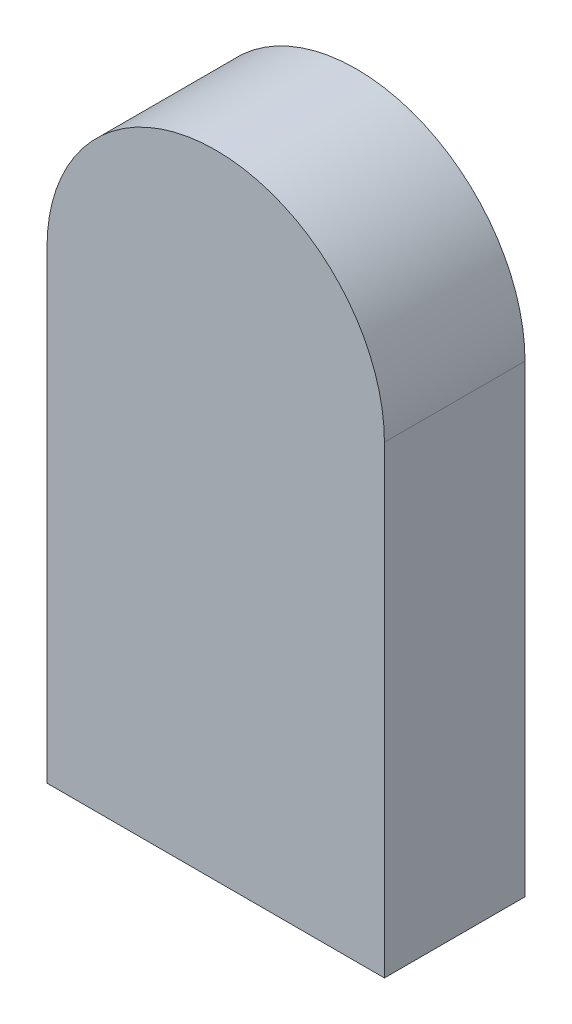
ISO-10303-21;
HEADER;
FILE_DESCRIPTION(('STEP AP214'),'2;1');
FILE_NAME('part.step','',(''),(''),'','','');
FILE_SCHEMA(('AUTOMOTIVE_DESIGN { 1 0 10303 214 1 1 1 1 }'));
ENDSEC;
DATA;
#1=APPLICATION_CONTEXT('core data for automotive mechanical design processes');
#2=APPLICATION_PROTOCOL_DEFINITION('international standard','automotive_design',2000,#1);
#3=PRODUCT_CONTEXT('',#1,'mechanical');
#4=PRODUCT('Part','Part','',(#3));
#5=PRODUCT_RELATED_PRODUCT_CATEGORY('part','',(#4));
#6=PRODUCT_DEFINITION_FORMATION('','',#4);
#7=PRODUCT_DEFINITION_CONTEXT('part definition',#1,'design');
#8=PRODUCT_DEFINITION('design','',#6,#7);
#9=PRODUCT_DEFINITION_SHAPE('','',#8);
#10=(LENGTH_UNIT() NAMED_UNIT(*) SI_UNIT(.MILLI.,.METRE.));
#11=(NAMED_UNIT(*) PLANE_ANGLE_UNIT() SI_UNIT($,.RADIAN.));
#12=(NAMED_UNIT(*) SI_UNIT($,.STERADIAN.) SOLID_ANGLE_UNIT());
#13=UNCERTAINTY_MEASURE_WITH_UNIT(LENGTH_MEASURE(1.E-05),#10,'distance_accuracy_value','');
#14=(GEOMETRIC_REPRESENTATION_CONTEXT(3) GLOBAL_UNCERTAINTY_ASSIGNED_CONTEXT((#13)) GLOBAL_UNIT_ASSIGNED_CONTEXT((#10,
#11,#12)) REPRESENTATION_CONTEXT('',''));
#15=CARTESIAN_POINT('',(0.,0.,0.));
#16=DIRECTION('',(0.,0.,1.));
#17=DIRECTION('',(1.,0.,0.));
#18=AXIS2_PLACEMENT_3D('',#15,#16,#17);
#19=CARTESIAN_POINT('',(-0.37,-4.05,0.));
#20=DIRECTION('',(0.,1.,0.));
#21=DIRECTION('',(1.,0.,0.));
#22=AXIS2_PLACEMENT_3D('',#19,#20,#21);
#23=PLANE('',#22);
#24=DIRECTION('',(1.,0.,0.));
#25=VECTOR('',#24,1.);
#26=CARTESIAN_POINT('',(-0.37,-4.05,0.));
#27=LINE('',#26,#25);
#28=CARTESIAN_POINT('',(-0.37,-4.05,0.));
#29=VERTEX_POINT('',#28);
#30=CARTESIAN_POINT('',(-0.13,-4.05,0.));
#31=VERTEX_POINT('',#30);
#32=EDGE_CURVE('E11',#29,#31,#27,.T.);
#33=ORIENTED_EDGE('',*,*,#32,.T.);
#34=DIRECTION('',(0.,0.,1.));
#35=VECTOR('',#34,1.);
#36=CARTESIAN_POINT('',(-0.13,-4.05,0.));
#37=LINE('',#36,#35);
#38=CARTESIAN_POINT('',(-0.13,-4.05,0.1));
#39=VERTEX_POINT('',#38);
#40=EDGE_CURVE('E24',#31,#39,#37,.T.);
#41=ORIENTED_EDGE('',*,*,#40,.T.);
#42=DIRECTION('',(1.,0.,0.));
#43=VECTOR('',#42,1.);
#44=CARTESIAN_POINT('',(-0.37,-4.05,0.1));
#45=LINE('',#44,#43);
#46=CARTESIAN_POINT('',(-0.37,-4.05,0.1));
#47=VERTEX_POINT('',#46);
#48=EDGE_CURVE('E87',#47,#39,#45,.T.);
#49=ORIENTED_EDGE('',*,*,#48,.F.);
#50=DIRECTION('',(0.,0.,1.));
#51=VECTOR('',#50,1.);
#52=CARTESIAN_POINT('',(-0.37,-4.05,0.));
#53=LINE('',#52,#51);
#54=EDGE_CURVE('E36',#29,#47,#53,.T.);
#55=ORIENTED_EDGE('',*,*,#54,.F.);
#56=EDGE_LOOP('',(#33,#41,#49,#55));
#57=FACE_BOUND('',#56,.T.);
#58=ADVANCED_FACE('F17',(#57),#23,.F.);
#59=CARTESIAN_POINT('',(-0.13,-4.05,0.));
#60=DIRECTION('',(-1.,0.,0.));
#61=DIRECTION('',(0.,1.,0.));
#62=AXIS2_PLACEMENT_3D('',#59,#60,#61);
#63=PLANE('',#62);
#64=DIRECTION('',(0.,1.,0.));
#65=VECTOR('',#64,1.);
#66=CARTESIAN_POINT('',(-0.13,-4.05,0.));
#67=LINE('',#66,#65);
#68=CARTESIAN_POINT('',(-0.13,-3.72,0.));
#69=VERTEX_POINT('',#68);
#70=EDGE_CURVE('E84',#31,#69,#67,.T.);
#71=ORIENTED_EDGE('',*,*,#70,.T.);
#72=DIRECTION('',(0.,0.,1.));
#73=VECTOR('',#72,1.);
#74=CARTESIAN_POINT('',(-0.13,-3.72,0.));
#75=LINE('',#74,#73);
#76=CARTESIAN_POINT('',(-0.13,-3.72,0.1));
#77=VERTEX_POINT('',#76);
#78=EDGE_CURVE('E82',#69,#77,#75,.T.);
#79=ORIENTED_EDGE('',*,*,#78,.T.);
#80=DIRECTION('',(0.,1.,0.));
#81=VECTOR('',#80,1.);
#82=CARTESIAN_POINT('',(-0.13,-4.05,0.1));
#83=LINE('',#82,#81);
#84=EDGE_CURVE('E72',#39,#77,#83,.T.);
#85=ORIENTED_EDGE('',*,*,#84,.F.);
#86=ORIENTED_EDGE('',*,*,#40,.F.);
#87=EDGE_LOOP('',(#71,#79,#85,#86));
#88=FACE_BOUND('',#87,.T.);
#89=ADVANCED_FACE('F89',(#88),#63,.F.);
#90=CARTESIAN_POINT('',(-0.25,-3.72,0.));
#91=DIRECTION('',(0.,0.,-1.));
#92=DIRECTION('',(1.,0.,0.));
#93=AXIS2_PLACEMENT_3D('',#90,#91,#92);
#94=CYLINDRICAL_SURFACE('',#93,0.12);
#95=CARTESIAN_POINT('',(-0.25,-3.72,0.));
#96=DIRECTION('',(0.,0.,1.));
#97=DIRECTION('',(1.,0.,0.));
#98=AXIS2_PLACEMENT_3D('',#95,#96,#97);
#99=CIRCLE('',#98,0.12);
#100=CARTESIAN_POINT('',(-0.37,-3.72,0.));
#101=VERTEX_POINT('',#100);
#102=EDGE_CURVE('E62',#69,#101,#99,.T.);
#103=ORIENTED_EDGE('',*,*,#102,.T.);
#104=DIRECTION('',(0.,0.,1.));
#105=VECTOR('',#104,1.);
#106=CARTESIAN_POINT('',(-0.37,-3.72,0.));
#107=LINE('',#106,#105);
#108=CARTESIAN_POINT('',(-0.37,-3.72,0.1));
#109=VERTEX_POINT('',#108);
#110=EDGE_CURVE('E57',#101,#109,#107,.T.);
#111=ORIENTED_EDGE('',*,*,#110,.T.);
#112=CARTESIAN_POINT('',(-0.25,-3.72,0.1));
#113=DIRECTION('',(0.,0.,1.));
#114=DIRECTION('',(1.,0.,0.));
#115=AXIS2_PLACEMENT_3D('',#112,#113,#114);
#116=CIRCLE('',#115,0.12);
#117=EDGE_CURVE('E60',#77,#109,#116,.T.);
#118=ORIENTED_EDGE('',*,*,#117,.F.);
#119=ORIENTED_EDGE('',*,*,#78,.F.);
#120=EDGE_LOOP('',(#103,#111,#118,#119));
#121=FACE_BOUND('',#120,.T.);
#122=ADVANCED_FACE('F59',(#121),#94,.T.);
#123=CARTESIAN_POINT('',(-0.37,-4.05,0.));
#124=DIRECTION('',(-1.,0.,0.));
#125=DIRECTION('',(0.,1.,0.));
#126=AXIS2_PLACEMENT_3D('',#123,#124,#125);
#127=PLANE('',#126);
#128=ORIENTED_EDGE('',*,*,#54,.T.);
#129=DIRECTION('',(0.,1.,0.));
#130=VECTOR('',#129,1.);
#131=CARTESIAN_POINT('',(-0.37,-4.05,0.1));
#132=LINE('',#131,#130);
#133=EDGE_CURVE('E71',#47,#109,#132,.T.);
#134=ORIENTED_EDGE('',*,*,#133,.T.);
#135=ORIENTED_EDGE('',*,*,#110,.F.);
#136=DIRECTION('',(0.,1.,0.));
#137=VECTOR('',#136,1.);
#138=CARTESIAN_POINT('',(-0.37,-4.05,0.));
#139=LINE('',#138,#137);
#140=EDGE_CURVE('E76',#29,#101,#139,.T.);
#141=ORIENTED_EDGE('',*,*,#140,.F.);
#142=EDGE_LOOP('',(#128,#134,#135,#141));
#143=FACE_BOUND('',#142,.T.);
#144=ADVANCED_FACE('F75',(#143),#127,.T.);
#145=CARTESIAN_POINT('',(-0.25,-3.849490847913,0.));
#146=DIRECTION('',(0.,0.,1.));
#147=DIRECTION('',(1.,0.,0.));
#148=AXIS2_PLACEMENT_3D('',#145,#146,#147);
#149=PLANE('',#148);
#150=ORIENTED_EDGE('',*,*,#140,.T.);
#151=ORIENTED_EDGE('',*,*,#102,.F.);
#152=ORIENTED_EDGE('',*,*,#70,.F.);
#153=ORIENTED_EDGE('',*,*,#32,.F.);
#154=EDGE_LOOP('',(#150,#151,#152,#153));
#155=FACE_BOUND('',#154,.T.);
#156=ADVANCED_FACE('F91',(#155),#149,.F.);
#157=CARTESIAN_POINT('',(-0.25,-3.849490847913,0.1));
#158=DIRECTION('',(0.,0.,1.));
#159=DIRECTION('',(1.,0.,0.));
#160=AXIS2_PLACEMENT_3D('',#157,#158,#159);
#161=PLANE('',#160);
#162=ORIENTED_EDGE('',*,*,#48,.T.);
#163=ORIENTED_EDGE('',*,*,#84,.T.);
#164=ORIENTED_EDGE('',*,*,#117,.T.);
#165=ORIENTED_EDGE('',*,*,#133,.F.);
#166=EDGE_LOOP('',(#162,#163,#164,#165));
#167=FACE_BOUND('',#166,.T.);
#168=ADVANCED_FACE('F70',(#167),#161,.T.);
#169=CLOSED_SHELL('',(#58,#89,#122,#144,#156,#168));
#170=MANIFOLD_SOLID_BREP('B1',#169);
#171=ADVANCED_BREP_SHAPE_REPRESENTATION('',(#18,#170),#14);
#172=SHAPE_DEFINITION_REPRESENTATION(#9,#171);
ENDSEC;
END-ISO-10303-21;
